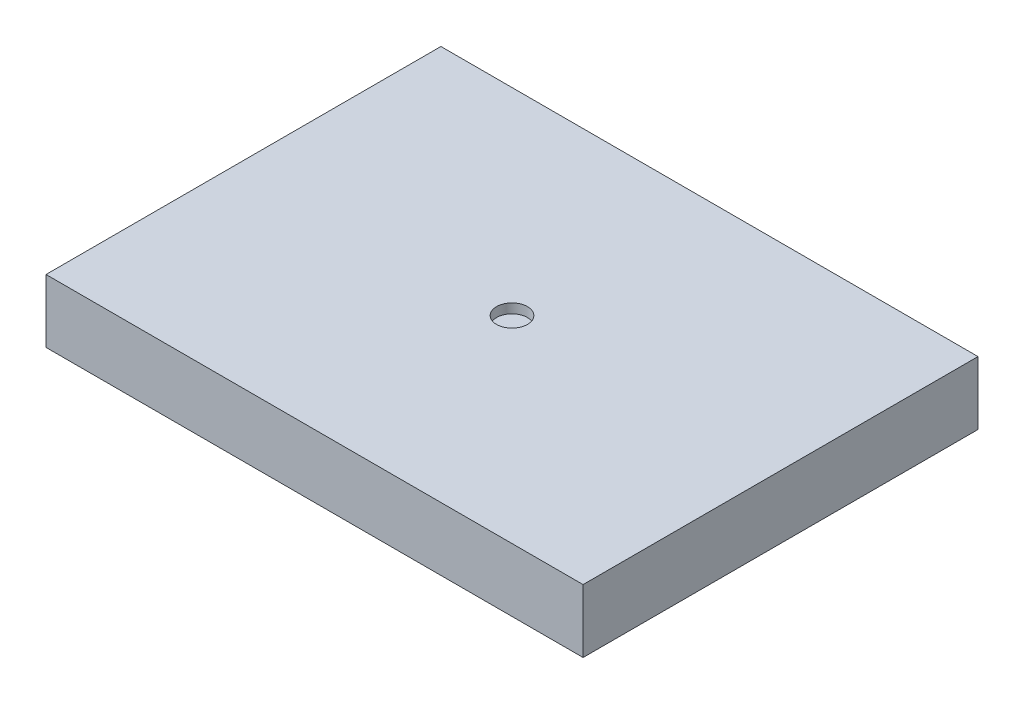
ISO-10303-21;
HEADER;
FILE_DESCRIPTION(('STEP AP214'),'2;1');
FILE_NAME('part.step','',(''),(''),'','','');
FILE_SCHEMA(('AUTOMOTIVE_DESIGN { 1 0 10303 214 1 1 1 1 }'));
ENDSEC;
DATA;
#1=APPLICATION_CONTEXT('core data for automotive mechanical design processes');
#2=APPLICATION_PROTOCOL_DEFINITION('international standard','automotive_design',2000,#1);
#3=PRODUCT_CONTEXT('',#1,'mechanical');
#4=PRODUCT('Part','Part','',(#3));
#5=PRODUCT_RELATED_PRODUCT_CATEGORY('part','',(#4));
#6=PRODUCT_DEFINITION_FORMATION('','',#4);
#7=PRODUCT_DEFINITION_CONTEXT('part definition',#1,'design');
#8=PRODUCT_DEFINITION('design','',#6,#7);
#9=PRODUCT_DEFINITION_SHAPE('','',#8);
#10=(LENGTH_UNIT() NAMED_UNIT(*) SI_UNIT(.MILLI.,.METRE.));
#11=(NAMED_UNIT(*) PLANE_ANGLE_UNIT() SI_UNIT($,.RADIAN.));
#12=(NAMED_UNIT(*) SI_UNIT($,.STERADIAN.) SOLID_ANGLE_UNIT());
#13=UNCERTAINTY_MEASURE_WITH_UNIT(LENGTH_MEASURE(1.E-05),#10,'distance_accuracy_value','');
#14=(GEOMETRIC_REPRESENTATION_CONTEXT(3) GLOBAL_UNCERTAINTY_ASSIGNED_CONTEXT((#13)) GLOBAL_UNIT_ASSIGNED_CONTEXT((#10,
#11,#12)) REPRESENTATION_CONTEXT('',''));
#15=CARTESIAN_POINT('',(0.,0.,0.));
#16=DIRECTION('',(0.,0.,1.));
#17=DIRECTION('',(1.,0.,0.));
#18=AXIS2_PLACEMENT_3D('',#15,#16,#17);
#19=CARTESIAN_POINT('',(21.59,5.08,-15.875));
#20=DIRECTION('',(-1.,0.,0.));
#21=DIRECTION('',(0.,0.,1.));
#22=AXIS2_PLACEMENT_3D('',#19,#20,#21);
#23=PLANE('',#22);
#24=DIRECTION('',(0.,0.,-1.));
#25=VECTOR('',#24,1.);
#26=CARTESIAN_POINT('',(21.59,0.,-15.875));
#27=LINE('',#26,#25);
#28=CARTESIAN_POINT('',(21.59,0.,15.875));
#29=VERTEX_POINT('',#28);
#30=CARTESIAN_POINT('',(21.59,0.,-15.875));
#31=VERTEX_POINT('',#30);
#32=EDGE_CURVE('E98',#29,#31,#27,.T.);
#33=ORIENTED_EDGE('',*,*,#32,.T.);
#34=DIRECTION('',(0.,-1.,0.));
#35=VECTOR('',#34,1.);
#36=CARTESIAN_POINT('',(21.59,5.08,-15.875));
#37=LINE('',#36,#35);
#38=CARTESIAN_POINT('',(21.59,5.08,-15.875));
#39=VERTEX_POINT('',#38);
#40=EDGE_CURVE('E11',#39,#31,#37,.T.);
#41=ORIENTED_EDGE('',*,*,#40,.F.);
#42=DIRECTION('',(0.,0.,-1.));
#43=VECTOR('',#42,1.);
#44=CARTESIAN_POINT('',(21.59,5.08,-15.875));
#45=LINE('',#44,#43);
#46=CARTESIAN_POINT('',(21.59,5.08,15.875));
#47=VERTEX_POINT('',#46);
#48=EDGE_CURVE('E86',#47,#39,#45,.T.);
#49=ORIENTED_EDGE('',*,*,#48,.F.);
#50=DIRECTION('',(0.,-1.,0.));
#51=VECTOR('',#50,1.);
#52=CARTESIAN_POINT('',(21.59,5.08,15.875));
#53=LINE('',#52,#51);
#54=EDGE_CURVE('E94',#47,#29,#53,.T.);
#55=ORIENTED_EDGE('',*,*,#54,.T.);
#56=EDGE_LOOP('',(#33,#41,#49,#55));
#57=FACE_BOUND('',#56,.T.);
#58=ADVANCED_FACE('F35',(#57),#23,.F.);
#59=CARTESIAN_POINT('',(-21.59,5.08,-15.875));
#60=DIRECTION('',(0.,0.,1.));
#61=DIRECTION('',(1.,0.,0.));
#62=AXIS2_PLACEMENT_3D('',#59,#60,#61);
#63=PLANE('',#62);
#64=DIRECTION('',(-1.,0.,0.));
#65=VECTOR('',#64,1.);
#66=CARTESIAN_POINT('',(-21.59,0.,-15.875));
#67=LINE('',#66,#65);
#68=CARTESIAN_POINT('',(-21.59,0.,-15.875));
#69=VERTEX_POINT('',#68);
#70=EDGE_CURVE('E90',#31,#69,#67,.T.);
#71=ORIENTED_EDGE('',*,*,#70,.T.);
#72=DIRECTION('',(0.,-1.,0.));
#73=VECTOR('',#72,1.);
#74=CARTESIAN_POINT('',(-21.59,5.08,-15.875));
#75=LINE('',#74,#73);
#76=CARTESIAN_POINT('',(-21.59,5.08,-15.875));
#77=VERTEX_POINT('',#76);
#78=EDGE_CURVE('E43',#77,#69,#75,.T.);
#79=ORIENTED_EDGE('',*,*,#78,.F.);
#80=DIRECTION('',(-1.,0.,0.));
#81=VECTOR('',#80,1.);
#82=CARTESIAN_POINT('',(-21.59,5.08,-15.875));
#83=LINE('',#82,#81);
#84=EDGE_CURVE('E81',#39,#77,#83,.T.);
#85=ORIENTED_EDGE('',*,*,#84,.F.);
#86=ORIENTED_EDGE('',*,*,#40,.T.);
#87=EDGE_LOOP('',(#71,#79,#85,#86));
#88=FACE_BOUND('',#87,.T.);
#89=ADVANCED_FACE('F89',(#88),#63,.F.);
#90=CARTESIAN_POINT('',(-21.59,5.08,-15.875));
#91=DIRECTION('',(1.,0.,0.));
#92=DIRECTION('',(0.,0.,-1.));
#93=AXIS2_PLACEMENT_3D('',#90,#91,#92);
#94=PLANE('',#93);
#95=DIRECTION('',(0.,0.,1.));
#96=VECTOR('',#95,1.);
#97=CARTESIAN_POINT('',(-21.59,0.,-15.875));
#98=LINE('',#97,#96);
#99=CARTESIAN_POINT('',(-21.59,0.,15.875));
#100=VERTEX_POINT('',#99);
#101=EDGE_CURVE('E68',#69,#100,#98,.T.);
#102=ORIENTED_EDGE('',*,*,#101,.T.);
#103=DIRECTION('',(0.,-1.,0.));
#104=VECTOR('',#103,1.);
#105=CARTESIAN_POINT('',(-21.59,5.08,15.875));
#106=LINE('',#105,#104);
#107=CARTESIAN_POINT('',(-21.59,5.08,15.875));
#108=VERTEX_POINT('',#107);
#109=EDGE_CURVE('E91',#108,#100,#106,.T.);
#110=ORIENTED_EDGE('',*,*,#109,.F.);
#111=DIRECTION('',(0.,0.,1.));
#112=VECTOR('',#111,1.);
#113=CARTESIAN_POINT('',(-21.59,5.08,-15.875));
#114=LINE('',#113,#112);
#115=EDGE_CURVE('E84',#77,#108,#114,.T.);
#116=ORIENTED_EDGE('',*,*,#115,.F.);
#117=ORIENTED_EDGE('',*,*,#78,.T.);
#118=EDGE_LOOP('',(#102,#110,#116,#117));
#119=FACE_BOUND('',#118,.T.);
#120=ADVANCED_FACE('F92',(#119),#94,.F.);
#121=CARTESIAN_POINT('',(-21.59,5.08,15.875));
#122=DIRECTION('',(0.,0.,-1.));
#123=DIRECTION('',(-1.,0.,0.));
#124=AXIS2_PLACEMENT_3D('',#121,#122,#123);
#125=PLANE('',#124);
#126=DIRECTION('',(1.,0.,0.));
#127=VECTOR('',#126,1.);
#128=CARTESIAN_POINT('',(-21.59,0.,15.875));
#129=LINE('',#128,#127);
#130=EDGE_CURVE('E74',#100,#29,#129,.T.);
#131=ORIENTED_EDGE('',*,*,#130,.T.);
#132=ORIENTED_EDGE('',*,*,#54,.F.);
#133=DIRECTION('',(1.,0.,0.));
#134=VECTOR('',#133,1.);
#135=CARTESIAN_POINT('',(-21.59,5.08,15.875));
#136=LINE('',#135,#134);
#137=EDGE_CURVE('E51',#108,#47,#136,.T.);
#138=ORIENTED_EDGE('',*,*,#137,.F.);
#139=ORIENTED_EDGE('',*,*,#109,.T.);
#140=EDGE_LOOP('',(#131,#132,#138,#139));
#141=FACE_BOUND('',#140,.T.);
#142=ADVANCED_FACE('F106',(#141),#125,.F.);
#143=CARTESIAN_POINT('',(0.,5.08,0.));
#144=DIRECTION('',(0.,1.,0.));
#145=DIRECTION('',(0.,0.,1.));
#146=AXIS2_PLACEMENT_3D('',#143,#144,#145);
#147=PLANE('',#146);
#148=CARTESIAN_POINT('',(0.,5.08,0.));
#149=DIRECTION('',(0.,1.,0.));
#150=DIRECTION('',(0.,0.,1.));
#151=AXIS2_PLACEMENT_3D('',#148,#149,#150);
#152=CIRCLE('',#151,1.24202552878661);
#153=CARTESIAN_POINT('',(0.,5.08,1.24202552878661));
#154=VERTEX_POINT('',#153);
#155=EDGE_CURVE('E112',#154,#154,#152,.T.);
#156=ORIENTED_EDGE('',*,*,#155,.F.);
#157=EDGE_LOOP('',(#156));
#158=FACE_BOUND('',#157,.T.);
#159=ORIENTED_EDGE('',*,*,#48,.T.);
#160=ORIENTED_EDGE('',*,*,#84,.T.);
#161=ORIENTED_EDGE('',*,*,#115,.T.);
#162=ORIENTED_EDGE('',*,*,#137,.T.);
#163=EDGE_LOOP('',(#159,#160,#161,#162));
#164=FACE_BOUND('',#163,.T.);
#165=ADVANCED_FACE('F82',(#158,#164),#147,.T.);
#166=CARTESIAN_POINT('',(0.,0.,0.));
#167=DIRECTION('',(0.,1.,0.));
#168=DIRECTION('',(0.,0.,1.));
#169=AXIS2_PLACEMENT_3D('',#166,#167,#168);
#170=PLANE('',#169);
#171=ORIENTED_EDGE('',*,*,#32,.F.);
#172=ORIENTED_EDGE('',*,*,#130,.F.);
#173=ORIENTED_EDGE('',*,*,#101,.F.);
#174=ORIENTED_EDGE('',*,*,#70,.F.);
#175=EDGE_LOOP('',(#171,#172,#173,#174));
#176=FACE_BOUND('',#175,.T.);
#177=ADVANCED_FACE('F109',(#176),#170,.F.);
#178=CARTESIAN_POINT('',(0.,4.318,0.));
#179=DIRECTION('',(0.,1.,0.));
#180=DIRECTION('',(0.,0.,1.));
#181=AXIS2_PLACEMENT_3D('',#178,#179,#180);
#182=CYLINDRICAL_SURFACE('',#181,1.24202552878661);
#183=CARTESIAN_POINT('',(0.,4.318,0.));
#184=DIRECTION('',(0.,1.,0.));
#185=DIRECTION('',(0.,0.,1.));
#186=AXIS2_PLACEMENT_3D('',#183,#184,#185);
#187=CIRCLE('',#186,1.24202552878661);
#188=CARTESIAN_POINT('',(0.,4.318,1.24202552878661));
#189=VERTEX_POINT('',#188);
#190=EDGE_CURVE('E101',#189,#189,#187,.T.);
#191=ORIENTED_EDGE('',*,*,#190,.F.);
#192=EDGE_LOOP('',(#191));
#193=FACE_BOUND('',#192,.T.);
#194=ORIENTED_EDGE('',*,*,#155,.T.);
#195=EDGE_LOOP('',(#194));
#196=FACE_BOUND('',#195,.T.);
#197=ADVANCED_FACE('F120',(#193,#196),#182,.F.);
#198=CARTESIAN_POINT('',(0.,4.318,0.));
#199=DIRECTION('',(0.,1.,0.));
#200=DIRECTION('',(0.,0.,1.));
#201=AXIS2_PLACEMENT_3D('',#198,#199,#200);
#202=PLANE('',#201);
#203=ORIENTED_EDGE('',*,*,#190,.T.);
#204=EDGE_LOOP('',(#203));
#205=FACE_BOUND('',#204,.T.);
#206=ADVANCED_FACE('F118',(#205),#202,.T.);
#207=CLOSED_SHELL('',(#58,#89,#120,#142,#165,#177,#197,#206));
#208=MANIFOLD_SOLID_BREP('B2',#207);
#209=ADVANCED_BREP_SHAPE_REPRESENTATION('',(#18,#208),#14);
#210=SHAPE_DEFINITION_REPRESENTATION(#9,#209);
ENDSEC;
END-ISO-10303-21;
